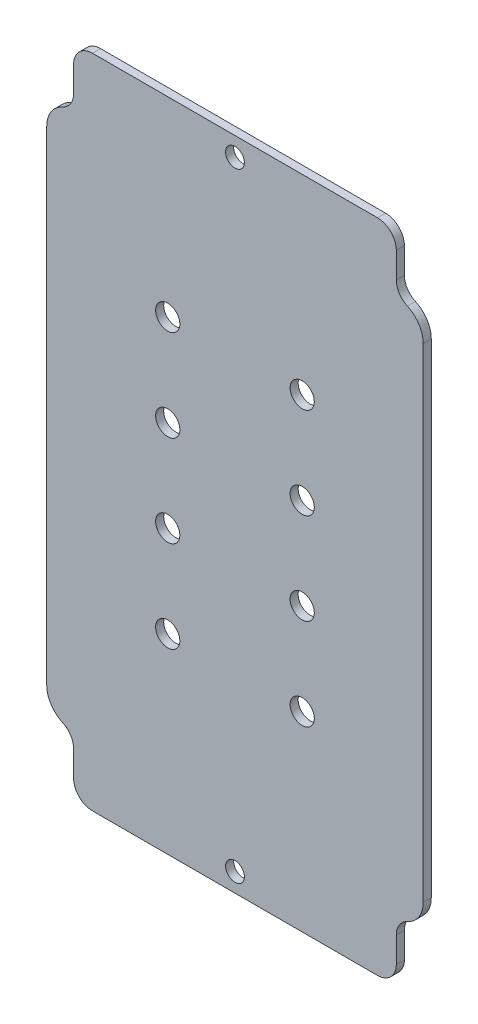
ISO-10303-21;
HEADER;
FILE_DESCRIPTION(('STEP AP214'),'2;1');
FILE_NAME('part.step','',(''),(''),'','','');
FILE_SCHEMA(('AUTOMOTIVE_DESIGN { 1 0 10303 214 1 1 1 1 }'));
ENDSEC;
DATA;
#1=APPLICATION_CONTEXT('core data for automotive mechanical design processes');
#2=APPLICATION_PROTOCOL_DEFINITION('international standard','automotive_design',2000,#1);
#3=PRODUCT_CONTEXT('',#1,'mechanical');
#4=PRODUCT('Part','Part','',(#3));
#5=PRODUCT_RELATED_PRODUCT_CATEGORY('part','',(#4));
#6=PRODUCT_DEFINITION_FORMATION('','',#4);
#7=PRODUCT_DEFINITION_CONTEXT('part definition',#1,'design');
#8=PRODUCT_DEFINITION('design','',#6,#7);
#9=PRODUCT_DEFINITION_SHAPE('','',#8);
#10=(LENGTH_UNIT() NAMED_UNIT(*) SI_UNIT(.MILLI.,.METRE.));
#11=(NAMED_UNIT(*) PLANE_ANGLE_UNIT() SI_UNIT($,.RADIAN.));
#12=(NAMED_UNIT(*) SI_UNIT($,.STERADIAN.) SOLID_ANGLE_UNIT());
#13=UNCERTAINTY_MEASURE_WITH_UNIT(LENGTH_MEASURE(1.E-05),#10,'distance_accuracy_value','');
#14=(GEOMETRIC_REPRESENTATION_CONTEXT(3) GLOBAL_UNCERTAINTY_ASSIGNED_CONTEXT((#13)) GLOBAL_UNIT_ASSIGNED_CONTEXT((#10,
#11,#12)) REPRESENTATION_CONTEXT('',''));
#15=CARTESIAN_POINT('',(0.,0.,0.));
#16=DIRECTION('',(0.,0.,1.));
#17=DIRECTION('',(1.,0.,0.));
#18=AXIS2_PLACEMENT_3D('',#15,#16,#17);
#19=CARTESIAN_POINT('',(123.,215.,123.));
#20=DIRECTION('',(0.,0.,1.));
#21=DIRECTION('',(1.,0.,0.));
#22=AXIS2_PLACEMENT_3D('',#19,#20,#21);
#23=PLANE('',#22);
#24=CARTESIAN_POINT('',(45.,49.,123.));
#25=DIRECTION('',(0.,0.,1.));
#26=DIRECTION('',(-1.,0.,0.));
#27=AXIS2_PLACEMENT_3D('',#24,#25,#26);
#28=CIRCLE('',#27,4.50000000000001);
#29=CARTESIAN_POINT('',(40.5,49.,123.));
#30=VERTEX_POINT('',#29);
#31=EDGE_CURVE('E438',#30,#30,#28,.T.);
#32=ORIENTED_EDGE('',*,*,#31,.F.);
#33=EDGE_LOOP('',(#32));
#34=FACE_BOUND('',#33,.T.);
#35=CARTESIAN_POINT('',(95.,117.,123.));
#36=DIRECTION('',(0.,0.,1.));
#37=DIRECTION('',(1.,0.,0.));
#38=AXIS2_PLACEMENT_3D('',#35,#36,#37);
#39=CIRCLE('',#38,4.50000000000001);
#40=CARTESIAN_POINT('',(99.5,117.,123.));
#41=VERTEX_POINT('',#40);
#42=EDGE_CURVE('E452',#41,#41,#39,.T.);
#43=ORIENTED_EDGE('',*,*,#42,.F.);
#44=EDGE_LOOP('',(#43));
#45=FACE_BOUND('',#44,.T.);
#46=CARTESIAN_POINT('',(45.,117.,123.));
#47=DIRECTION('',(0.,0.,1.));
#48=DIRECTION('',(1.,0.,0.));
#49=AXIS2_PLACEMENT_3D('',#46,#47,#48);
#50=CIRCLE('',#49,4.50000000000001);
#51=CARTESIAN_POINT('',(49.5,117.,123.));
#52=VERTEX_POINT('',#51);
#53=EDGE_CURVE('E464',#52,#52,#50,.T.);
#54=ORIENTED_EDGE('',*,*,#53,.F.);
#55=EDGE_LOOP('',(#54));
#56=FACE_BOUND('',#55,.T.);
#57=CARTESIAN_POINT('',(45.,151.,123.));
#58=DIRECTION('',(0.,0.,1.));
#59=DIRECTION('',(1.,0.,0.));
#60=AXIS2_PLACEMENT_3D('',#57,#58,#59);
#61=CIRCLE('',#60,4.50000000000001);
#62=CARTESIAN_POINT('',(49.5,151.,123.));
#63=VERTEX_POINT('',#62);
#64=EDGE_CURVE('E474',#63,#63,#61,.T.);
#65=ORIENTED_EDGE('',*,*,#64,.F.);
#66=EDGE_LOOP('',(#65));
#67=FACE_BOUND('',#66,.T.);
#68=CARTESIAN_POINT('',(70.,-15.,123.));
#69=DIRECTION('',(0.,0.,1.));
#70=DIRECTION('',(1.,0.,0.));
#71=AXIS2_PLACEMENT_3D('',#68,#69,#70);
#72=CIRCLE('',#71,3.50000000000001);
#73=CARTESIAN_POINT('',(73.5,-15.,123.));
#74=VERTEX_POINT('',#73);
#75=EDGE_CURVE('E225',#74,#74,#72,.T.);
#76=ORIENTED_EDGE('',*,*,#75,.F.);
#77=EDGE_LOOP('',(#76));
#78=FACE_BOUND('',#77,.T.);
#79=CARTESIAN_POINT('',(123.,215.,123.));
#80=DIRECTION('',(0.,0.,1.));
#81=DIRECTION('',(1.,0.,0.));
#82=AXIS2_PLACEMENT_3D('',#79,#80,#81);
#83=CIRCLE('',#82,7.00000000000001);
#84=CARTESIAN_POINT('',(130.,215.,123.));
#85=VERTEX_POINT('',#84);
#86=CARTESIAN_POINT('',(123.,222.,123.));
#87=VERTEX_POINT('',#86);
#88=EDGE_CURVE('E259',#85,#87,#83,.T.);
#89=ORIENTED_EDGE('',*,*,#88,.T.);
#90=DIRECTION('',(-1.,0.,0.));
#91=VECTOR('',#90,1.);
#92=CARTESIAN_POINT('',(123.,222.,123.));
#93=LINE('',#92,#91);
#94=CARTESIAN_POINT('',(17.,222.,123.));
#95=VERTEX_POINT('',#94);
#96=EDGE_CURVE('E144',#87,#95,#93,.T.);
#97=ORIENTED_EDGE('',*,*,#96,.T.);
#98=CARTESIAN_POINT('',(17.,215.,123.));
#99=DIRECTION('',(0.,0.,1.));
#100=DIRECTION('',(1.,0.,0.));
#101=AXIS2_PLACEMENT_3D('',#98,#99,#100);
#102=CIRCLE('',#101,7.);
#103=CARTESIAN_POINT('',(10.,215.,123.));
#104=VERTEX_POINT('',#103);
#105=EDGE_CURVE('E309',#95,#104,#102,.T.);
#106=ORIENTED_EDGE('',*,*,#105,.T.);
#107=DIRECTION('',(0.,-1.,0.));
#108=VECTOR('',#107,1.);
#109=CARTESIAN_POINT('',(10.,215.,123.));
#110=LINE('',#109,#108);
#111=CARTESIAN_POINT('',(10.,205.49193338483,123.));
#112=VERTEX_POINT('',#111);
#113=EDGE_CURVE('E328',#104,#112,#110,.T.);
#114=ORIENTED_EDGE('',*,*,#113,.T.);
#115=CARTESIAN_POINT('',(3.00000000000001,205.49193338483,123.));
#116=DIRECTION('',(0.,0.,-1.));
#117=DIRECTION('',(1.,0.,0.));
#118=AXIS2_PLACEMENT_3D('',#115,#116,#117);
#119=CIRCLE('',#118,7.);
#120=CARTESIAN_POINT('',(5.88235294117648,199.112901991076,123.));
#121=VERTEX_POINT('',#120);
#122=EDGE_CURVE('E326',#112,#121,#119,.T.);
#123=ORIENTED_EDGE('',*,*,#122,.T.);
#124=CARTESIAN_POINT('',(10.,190.,123.));
#125=DIRECTION('',(0.,0.,1.));
#126=DIRECTION('',(1.,0.,0.));
#127=AXIS2_PLACEMENT_3D('',#124,#125,#126);
#128=CIRCLE('',#127,10.);
#129=CARTESIAN_POINT('',(0.,190.,123.));
#130=VERTEX_POINT('',#129);
#131=EDGE_CURVE('E327',#121,#130,#128,.T.);
#132=ORIENTED_EDGE('',*,*,#131,.T.);
#133=DIRECTION('',(0.,-1.,0.));
#134=VECTOR('',#133,1.);
#135=CARTESIAN_POINT('',(0.,190.,123.));
#136=LINE('',#135,#134);
#137=CARTESIAN_POINT('',(0.,10.,123.));
#138=VERTEX_POINT('',#137);
#139=EDGE_CURVE('E332',#130,#138,#136,.T.);
#140=ORIENTED_EDGE('',*,*,#139,.T.);
#141=CARTESIAN_POINT('',(9.99999999999997,10.,123.));
#142=DIRECTION('',(0.,0.,1.));
#143=DIRECTION('',(-1.,0.,0.));
#144=AXIS2_PLACEMENT_3D('',#141,#142,#143);
#145=CIRCLE('',#144,10.);
#146=CARTESIAN_POINT('',(5.88235294117645,0.88709800892372,123.));
#147=VERTEX_POINT('',#146);
#148=EDGE_CURVE('E340',#138,#147,#145,.T.);
#149=ORIENTED_EDGE('',*,*,#148,.T.);
#150=CARTESIAN_POINT('',(2.99999999999997,-5.49193338482967,123.));
#151=DIRECTION('',(0.,0.,-1.));
#152=DIRECTION('',(-1.,0.,0.));
#153=AXIS2_PLACEMENT_3D('',#150,#151,#152);
#154=CIRCLE('',#153,7.);
#155=CARTESIAN_POINT('',(9.99999999999997,-5.49193338482967,123.));
#156=VERTEX_POINT('',#155);
#157=EDGE_CURVE('E336',#147,#156,#154,.T.);
#158=ORIENTED_EDGE('',*,*,#157,.T.);
#159=DIRECTION('',(0.,-1.,0.));
#160=VECTOR('',#159,1.);
#161=CARTESIAN_POINT('',(10.,-15.,123.));
#162=LINE('',#161,#160);
#163=CARTESIAN_POINT('',(10.,-15.,123.));
#164=VERTEX_POINT('',#163);
#165=EDGE_CURVE('E342',#156,#164,#162,.T.);
#166=ORIENTED_EDGE('',*,*,#165,.T.);
#167=CARTESIAN_POINT('',(17.,-15.,123.));
#168=DIRECTION('',(0.,0.,1.));
#169=DIRECTION('',(-1.,0.,0.));
#170=AXIS2_PLACEMENT_3D('',#167,#168,#169);
#171=CIRCLE('',#170,7.);
#172=CARTESIAN_POINT('',(17.,-22.,123.));
#173=VERTEX_POINT('',#172);
#174=EDGE_CURVE('E343',#164,#173,#171,.T.);
#175=ORIENTED_EDGE('',*,*,#174,.T.);
#176=DIRECTION('',(1.,0.,0.));
#177=VECTOR('',#176,1.);
#178=CARTESIAN_POINT('',(123.,-22.,123.));
#179=LINE('',#178,#177);
#180=CARTESIAN_POINT('',(123.,-22.,123.));
#181=VERTEX_POINT('',#180);
#182=EDGE_CURVE('E341',#173,#181,#179,.T.);
#183=ORIENTED_EDGE('',*,*,#182,.T.);
#184=CARTESIAN_POINT('',(123.,-15.,123.));
#185=DIRECTION('',(0.,0.,1.));
#186=DIRECTION('',(-1.,0.,0.));
#187=AXIS2_PLACEMENT_3D('',#184,#185,#186);
#188=CIRCLE('',#187,7.00000000000001);
#189=CARTESIAN_POINT('',(130.,-15.,123.));
#190=VERTEX_POINT('',#189);
#191=EDGE_CURVE('E350',#181,#190,#188,.T.);
#192=ORIENTED_EDGE('',*,*,#191,.T.);
#193=DIRECTION('',(0.,1.,0.));
#194=VECTOR('',#193,1.);
#195=CARTESIAN_POINT('',(130.,-5.49193338482973,123.));
#196=LINE('',#195,#194);
#197=CARTESIAN_POINT('',(130.,-5.49193338482973,123.));
#198=VERTEX_POINT('',#197);
#199=EDGE_CURVE('E349',#190,#198,#196,.T.);
#200=ORIENTED_EDGE('',*,*,#199,.T.);
#201=CARTESIAN_POINT('',(137.,-5.49193338482973,123.));
#202=DIRECTION('',(0.,0.,-1.));
#203=DIRECTION('',(-1.,0.,0.));
#204=AXIS2_PLACEMENT_3D('',#201,#202,#203);
#205=CIRCLE('',#204,7.00000000000001);
#206=CARTESIAN_POINT('',(134.117647058823,0.887098008923669,123.));
#207=VERTEX_POINT('',#206);
#208=EDGE_CURVE('E352',#198,#207,#205,.T.);
#209=ORIENTED_EDGE('',*,*,#208,.T.);
#210=CARTESIAN_POINT('',(130.,9.99999999999995,123.));
#211=DIRECTION('',(0.,0.,1.));
#212=DIRECTION('',(-1.,0.,0.));
#213=AXIS2_PLACEMENT_3D('',#210,#211,#212);
#214=CIRCLE('',#213,10.);
#215=CARTESIAN_POINT('',(140.,9.99999999999996,123.));
#216=VERTEX_POINT('',#215);
#217=EDGE_CURVE('E354',#207,#216,#214,.T.);
#218=ORIENTED_EDGE('',*,*,#217,.T.);
#219=DIRECTION('',(0.,1.,0.));
#220=VECTOR('',#219,1.);
#221=CARTESIAN_POINT('',(140.,30.,123.));
#222=LINE('',#221,#220);
#223=CARTESIAN_POINT('',(140.,190.,123.));
#224=VERTEX_POINT('',#223);
#225=EDGE_CURVE('E199',#216,#224,#222,.T.);
#226=ORIENTED_EDGE('',*,*,#225,.T.);
#227=CARTESIAN_POINT('',(130.,190.,123.));
#228=DIRECTION('',(0.,0.,1.));
#229=DIRECTION('',(1.,0.,0.));
#230=AXIS2_PLACEMENT_3D('',#227,#228,#229);
#231=CIRCLE('',#230,10.);
#232=CARTESIAN_POINT('',(134.117647058824,199.112901991076,123.));
#233=VERTEX_POINT('',#232);
#234=EDGE_CURVE('E194',#224,#233,#231,.T.);
#235=ORIENTED_EDGE('',*,*,#234,.T.);
#236=CARTESIAN_POINT('',(137.,205.49193338483,123.));
#237=DIRECTION('',(0.,0.,-1.));
#238=DIRECTION('',(1.,0.,0.));
#239=AXIS2_PLACEMENT_3D('',#236,#237,#238);
#240=CIRCLE('',#239,7.00000000000001);
#241=CARTESIAN_POINT('',(130.,205.49193338483,123.));
#242=VERTEX_POINT('',#241);
#243=EDGE_CURVE('E196',#233,#242,#240,.T.);
#244=ORIENTED_EDGE('',*,*,#243,.T.);
#245=DIRECTION('',(0.,1.,0.));
#246=VECTOR('',#245,1.);
#247=CARTESIAN_POINT('',(130.,205.49193338483,123.));
#248=LINE('',#247,#246);
#249=EDGE_CURVE('E67',#242,#85,#248,.T.);
#250=ORIENTED_EDGE('',*,*,#249,.T.);
#251=EDGE_LOOP('',(#89,#97,#106,#114,#123,#132,#140,#149,#158,#166,#175,#183,#192,#200,#209,
#218,#226,#235,#244,#250));
#252=FACE_BOUND('',#251,.T.);
#253=CARTESIAN_POINT('',(70.,215.,123.));
#254=DIRECTION('',(0.,0.,1.));
#255=DIRECTION('',(1.,0.,0.));
#256=AXIS2_PLACEMENT_3D('',#253,#254,#255);
#257=CIRCLE('',#256,3.50000000000001);
#258=CARTESIAN_POINT('',(73.5,215.,123.));
#259=VERTEX_POINT('',#258);
#260=EDGE_CURVE('E481',#259,#259,#257,.T.);
#261=ORIENTED_EDGE('',*,*,#260,.F.);
#262=EDGE_LOOP('',(#261));
#263=FACE_BOUND('',#262,.T.);
#264=CARTESIAN_POINT('',(95.,151.,123.));
#265=DIRECTION('',(0.,0.,1.));
#266=DIRECTION('',(1.,0.,0.));
#267=AXIS2_PLACEMENT_3D('',#264,#265,#266);
#268=CIRCLE('',#267,4.50000000000001);
#269=CARTESIAN_POINT('',(99.5,151.,123.));
#270=VERTEX_POINT('',#269);
#271=EDGE_CURVE('E469',#270,#270,#268,.T.);
#272=ORIENTED_EDGE('',*,*,#271,.F.);
#273=EDGE_LOOP('',(#272));
#274=FACE_BOUND('',#273,.T.);
#275=CARTESIAN_POINT('',(95.,83.,123.));
#276=DIRECTION('',(0.,0.,1.));
#277=DIRECTION('',(-1.,0.,0.));
#278=AXIS2_PLACEMENT_3D('',#275,#276,#277);
#279=CIRCLE('',#278,4.50000000000001);
#280=CARTESIAN_POINT('',(90.5,83.,123.));
#281=VERTEX_POINT('',#280);
#282=EDGE_CURVE('E460',#281,#281,#279,.T.);
#283=ORIENTED_EDGE('',*,*,#282,.F.);
#284=EDGE_LOOP('',(#283));
#285=FACE_BOUND('',#284,.T.);
#286=CARTESIAN_POINT('',(95.,49.,123.));
#287=DIRECTION('',(0.,0.,1.));
#288=DIRECTION('',(-1.,0.,0.));
#289=AXIS2_PLACEMENT_3D('',#286,#287,#288);
#290=CIRCLE('',#289,4.50000000000001);
#291=CARTESIAN_POINT('',(90.5,49.,123.));
#292=VERTEX_POINT('',#291);
#293=EDGE_CURVE('E443',#292,#292,#290,.T.);
#294=ORIENTED_EDGE('',*,*,#293,.F.);
#295=EDGE_LOOP('',(#294));
#296=FACE_BOUND('',#295,.T.);
#297=CARTESIAN_POINT('',(45.,83.,123.));
#298=DIRECTION('',(0.,0.,1.));
#299=DIRECTION('',(-1.,0.,0.));
#300=AXIS2_PLACEMENT_3D('',#297,#298,#299);
#301=CIRCLE('',#300,4.50000000000001);
#302=CARTESIAN_POINT('',(40.5,83.,123.));
#303=VERTEX_POINT('',#302);
#304=EDGE_CURVE('E429',#303,#303,#301,.T.);
#305=ORIENTED_EDGE('',*,*,#304,.F.);
#306=EDGE_LOOP('',(#305));
#307=FACE_BOUND('',#306,.T.);
#308=ADVANCED_FACE('F47',(#34,#45,#56,#67,#78,#252,#263,#274,#285,#296,#307),#23,.T.);
#309=CARTESIAN_POINT('',(123.,215.,120.));
#310=DIRECTION('',(0.,0.,1.));
#311=DIRECTION('',(1.,0.,0.));
#312=AXIS2_PLACEMENT_3D('',#309,#310,#311);
#313=PLANE('',#312);
#314=CARTESIAN_POINT('',(123.,215.,120.));
#315=DIRECTION('',(0.,0.,1.));
#316=DIRECTION('',(1.,0.,0.));
#317=AXIS2_PLACEMENT_3D('',#314,#315,#316);
#318=CIRCLE('',#317,7.00000000000001);
#319=CARTESIAN_POINT('',(130.,215.,120.));
#320=VERTEX_POINT('',#319);
#321=CARTESIAN_POINT('',(123.,222.,120.));
#322=VERTEX_POINT('',#321);
#323=EDGE_CURVE('E217',#320,#322,#318,.T.);
#324=ORIENTED_EDGE('',*,*,#323,.F.);
#325=DIRECTION('',(0.,1.,0.));
#326=VECTOR('',#325,1.);
#327=CARTESIAN_POINT('',(130.,205.49193338483,120.));
#328=LINE('',#327,#326);
#329=CARTESIAN_POINT('',(130.,205.49193338483,120.));
#330=VERTEX_POINT('',#329);
#331=EDGE_CURVE('E140',#330,#320,#328,.T.);
#332=ORIENTED_EDGE('',*,*,#331,.F.);
#333=CARTESIAN_POINT('',(137.,205.49193338483,120.));
#334=DIRECTION('',(0.,0.,-1.));
#335=DIRECTION('',(1.,0.,0.));
#336=AXIS2_PLACEMENT_3D('',#333,#334,#335);
#337=CIRCLE('',#336,7.00000000000001);
#338=CARTESIAN_POINT('',(134.117647058824,199.112901991076,120.));
#339=VERTEX_POINT('',#338);
#340=EDGE_CURVE('E132',#339,#330,#337,.T.);
#341=ORIENTED_EDGE('',*,*,#340,.F.);
#342=CARTESIAN_POINT('',(130.,190.,120.));
#343=DIRECTION('',(0.,0.,1.));
#344=DIRECTION('',(1.,0.,0.));
#345=AXIS2_PLACEMENT_3D('',#342,#343,#344);
#346=CIRCLE('',#345,10.);
#347=CARTESIAN_POINT('',(140.,190.,120.));
#348=VERTEX_POINT('',#347);
#349=EDGE_CURVE('E208',#348,#339,#346,.T.);
#350=ORIENTED_EDGE('',*,*,#349,.F.);
#351=DIRECTION('',(0.,1.,0.));
#352=VECTOR('',#351,1.);
#353=CARTESIAN_POINT('',(140.,170.,120.));
#354=LINE('',#353,#352);
#355=CARTESIAN_POINT('',(140.,9.99999999999996,120.));
#356=VERTEX_POINT('',#355);
#357=EDGE_CURVE('E255',#356,#348,#354,.T.);
#358=ORIENTED_EDGE('',*,*,#357,.F.);
#359=CARTESIAN_POINT('',(130.,9.99999999999995,120.));
#360=DIRECTION('',(0.,0.,1.));
#361=DIRECTION('',(-1.,0.,0.));
#362=AXIS2_PLACEMENT_3D('',#359,#360,#361);
#363=CIRCLE('',#362,10.);
#364=CARTESIAN_POINT('',(134.117647058823,0.887098008923669,120.));
#365=VERTEX_POINT('',#364);
#366=EDGE_CURVE('E253',#365,#356,#363,.T.);
#367=ORIENTED_EDGE('',*,*,#366,.F.);
#368=CARTESIAN_POINT('',(137.,-5.49193338482973,120.));
#369=DIRECTION('',(0.,0.,-1.));
#370=DIRECTION('',(-1.,0.,0.));
#371=AXIS2_PLACEMENT_3D('',#368,#369,#370);
#372=CIRCLE('',#371,7.00000000000001);
#373=CARTESIAN_POINT('',(130.,-5.49193338482973,120.));
#374=VERTEX_POINT('',#373);
#375=EDGE_CURVE('E249',#374,#365,#372,.T.);
#376=ORIENTED_EDGE('',*,*,#375,.F.);
#377=DIRECTION('',(0.,1.,0.));
#378=VECTOR('',#377,1.);
#379=CARTESIAN_POINT('',(130.,-5.49193338482973,120.));
#380=LINE('',#379,#378);
#381=CARTESIAN_POINT('',(130.,-15.,120.));
#382=VERTEX_POINT('',#381);
#383=EDGE_CURVE('E250',#382,#374,#380,.T.);
#384=ORIENTED_EDGE('',*,*,#383,.F.);
#385=CARTESIAN_POINT('',(123.,-15.,120.));
#386=DIRECTION('',(0.,0.,1.));
#387=DIRECTION('',(-1.,0.,0.));
#388=AXIS2_PLACEMENT_3D('',#385,#386,#387);
#389=CIRCLE('',#388,7.00000000000001);
#390=CARTESIAN_POINT('',(123.,-22.,120.));
#391=VERTEX_POINT('',#390);
#392=EDGE_CURVE('E243',#391,#382,#389,.T.);
#393=ORIENTED_EDGE('',*,*,#392,.F.);
#394=DIRECTION('',(1.,0.,0.));
#395=VECTOR('',#394,1.);
#396=CARTESIAN_POINT('',(123.,-22.,120.));
#397=LINE('',#396,#395);
#398=CARTESIAN_POINT('',(17.,-22.,120.));
#399=VERTEX_POINT('',#398);
#400=EDGE_CURVE('E244',#399,#391,#397,.T.);
#401=ORIENTED_EDGE('',*,*,#400,.F.);
#402=CARTESIAN_POINT('',(17.,-15.,120.));
#403=DIRECTION('',(0.,0.,1.));
#404=DIRECTION('',(-1.,0.,0.));
#405=AXIS2_PLACEMENT_3D('',#402,#403,#404);
#406=CIRCLE('',#405,7.);
#407=CARTESIAN_POINT('',(10.,-15.,120.));
#408=VERTEX_POINT('',#407);
#409=EDGE_CURVE('E242',#408,#399,#406,.T.);
#410=ORIENTED_EDGE('',*,*,#409,.F.);
#411=DIRECTION('',(0.,-1.,0.));
#412=VECTOR('',#411,1.);
#413=CARTESIAN_POINT('',(10.,-15.,120.));
#414=LINE('',#413,#412);
#415=CARTESIAN_POINT('',(9.99999999999997,-5.49193338482967,120.));
#416=VERTEX_POINT('',#415);
#417=EDGE_CURVE('E239',#416,#408,#414,.T.);
#418=ORIENTED_EDGE('',*,*,#417,.F.);
#419=CARTESIAN_POINT('',(2.99999999999997,-5.49193338482967,120.));
#420=DIRECTION('',(0.,0.,-1.));
#421=DIRECTION('',(-1.,0.,0.));
#422=AXIS2_PLACEMENT_3D('',#419,#420,#421);
#423=CIRCLE('',#422,7.);
#424=CARTESIAN_POINT('',(5.88235294117645,0.88709800892372,120.));
#425=VERTEX_POINT('',#424);
#426=EDGE_CURVE('E240',#425,#416,#423,.T.);
#427=ORIENTED_EDGE('',*,*,#426,.F.);
#428=CARTESIAN_POINT('',(9.99999999999997,10.,120.));
#429=DIRECTION('',(0.,0.,1.));
#430=DIRECTION('',(-1.,0.,0.));
#431=AXIS2_PLACEMENT_3D('',#428,#429,#430);
#432=CIRCLE('',#431,10.);
#433=CARTESIAN_POINT('',(0.,10.,120.));
#434=VERTEX_POINT('',#433);
#435=EDGE_CURVE('E231',#434,#425,#432,.T.);
#436=ORIENTED_EDGE('',*,*,#435,.F.);
#437=DIRECTION('',(0.,-1.,0.));
#438=VECTOR('',#437,1.);
#439=CARTESIAN_POINT('',(0.,10.,120.));
#440=LINE('',#439,#438);
#441=CARTESIAN_POINT('',(0.,190.,120.));
#442=VERTEX_POINT('',#441);
#443=EDGE_CURVE('E233',#442,#434,#440,.T.);
#444=ORIENTED_EDGE('',*,*,#443,.F.);
#445=CARTESIAN_POINT('',(10.,190.,120.));
#446=DIRECTION('',(0.,0.,1.));
#447=DIRECTION('',(1.,0.,0.));
#448=AXIS2_PLACEMENT_3D('',#445,#446,#447);
#449=CIRCLE('',#448,10.);
#450=CARTESIAN_POINT('',(5.88235294117648,199.112901991076,120.));
#451=VERTEX_POINT('',#450);
#452=EDGE_CURVE('E228',#451,#442,#449,.T.);
#453=ORIENTED_EDGE('',*,*,#452,.F.);
#454=CARTESIAN_POINT('',(3.00000000000001,205.49193338483,120.));
#455=DIRECTION('',(0.,0.,-1.));
#456=DIRECTION('',(1.,0.,0.));
#457=AXIS2_PLACEMENT_3D('',#454,#455,#456);
#458=CIRCLE('',#457,7.);
#459=CARTESIAN_POINT('',(10.,205.49193338483,120.));
#460=VERTEX_POINT('',#459);
#461=EDGE_CURVE('E229',#460,#451,#458,.T.);
#462=ORIENTED_EDGE('',*,*,#461,.F.);
#463=DIRECTION('',(0.,-1.,0.));
#464=VECTOR('',#463,1.);
#465=CARTESIAN_POINT('',(10.,215.,120.));
#466=LINE('',#465,#464);
#467=CARTESIAN_POINT('',(10.,215.,120.));
#468=VERTEX_POINT('',#467);
#469=EDGE_CURVE('E227',#468,#460,#466,.T.);
#470=ORIENTED_EDGE('',*,*,#469,.F.);
#471=CARTESIAN_POINT('',(17.,215.,120.));
#472=DIRECTION('',(0.,0.,1.));
#473=DIRECTION('',(1.,0.,0.));
#474=AXIS2_PLACEMENT_3D('',#471,#472,#473);
#475=CIRCLE('',#474,7.);
#476=CARTESIAN_POINT('',(17.,222.,120.));
#477=VERTEX_POINT('',#476);
#478=EDGE_CURVE('E221',#477,#468,#475,.T.);
#479=ORIENTED_EDGE('',*,*,#478,.F.);
#480=DIRECTION('',(-1.,0.,0.));
#481=VECTOR('',#480,1.);
#482=CARTESIAN_POINT('',(123.,222.,120.));
#483=LINE('',#482,#481);
#484=EDGE_CURVE('E222',#322,#477,#483,.T.);
#485=ORIENTED_EDGE('',*,*,#484,.F.);
#486=EDGE_LOOP('',(#324,#332,#341,#350,#358,#367,#376,#384,#393,#401,#410,#418,#427,#436,#444,
#453,#462,#470,#479,#485));
#487=FACE_BOUND('',#486,.T.);
#488=CARTESIAN_POINT('',(70.,-15.,120.));
#489=DIRECTION('',(0.,0.,1.));
#490=DIRECTION('',(1.,0.,0.));
#491=AXIS2_PLACEMENT_3D('',#488,#489,#490);
#492=CIRCLE('',#491,3.50000000000001);
#493=CARTESIAN_POINT('',(73.5,-15.,120.));
#494=VERTEX_POINT('',#493);
#495=EDGE_CURVE('E482',#494,#494,#492,.T.);
#496=ORIENTED_EDGE('',*,*,#495,.T.);
#497=EDGE_LOOP('',(#496));
#498=FACE_BOUND('',#497,.T.);
#499=CARTESIAN_POINT('',(70.,215.,120.));
#500=DIRECTION('',(0.,0.,1.));
#501=DIRECTION('',(1.,0.,0.));
#502=AXIS2_PLACEMENT_3D('',#499,#500,#501);
#503=CIRCLE('',#502,3.50000000000001);
#504=CARTESIAN_POINT('',(73.5,215.,120.));
#505=VERTEX_POINT('',#504);
#506=EDGE_CURVE('E476',#505,#505,#503,.T.);
#507=ORIENTED_EDGE('',*,*,#506,.T.);
#508=EDGE_LOOP('',(#507));
#509=FACE_BOUND('',#508,.T.);
#510=CARTESIAN_POINT('',(45.,151.,120.));
#511=DIRECTION('',(0.,0.,1.));
#512=DIRECTION('',(1.,0.,0.));
#513=AXIS2_PLACEMENT_3D('',#510,#511,#512);
#514=CIRCLE('',#513,4.50000000000001);
#515=CARTESIAN_POINT('',(49.5,151.,120.));
#516=VERTEX_POINT('',#515);
#517=EDGE_CURVE('E472',#516,#516,#514,.T.);
#518=ORIENTED_EDGE('',*,*,#517,.T.);
#519=EDGE_LOOP('',(#518));
#520=FACE_BOUND('',#519,.T.);
#521=CARTESIAN_POINT('',(95.,151.,120.));
#522=DIRECTION('',(0.,0.,1.));
#523=DIRECTION('',(1.,0.,0.));
#524=AXIS2_PLACEMENT_3D('',#521,#522,#523);
#525=CIRCLE('',#524,4.50000000000001);
#526=CARTESIAN_POINT('',(99.5,151.,120.));
#527=VERTEX_POINT('',#526);
#528=EDGE_CURVE('E467',#527,#527,#525,.T.);
#529=ORIENTED_EDGE('',*,*,#528,.T.);
#530=EDGE_LOOP('',(#529));
#531=FACE_BOUND('',#530,.T.);
#532=CARTESIAN_POINT('',(45.,117.,120.));
#533=DIRECTION('',(0.,0.,1.));
#534=DIRECTION('',(1.,0.,0.));
#535=AXIS2_PLACEMENT_3D('',#532,#533,#534);
#536=CIRCLE('',#535,4.50000000000001);
#537=CARTESIAN_POINT('',(49.5,117.,120.));
#538=VERTEX_POINT('',#537);
#539=EDGE_CURVE('E458',#538,#538,#536,.T.);
#540=ORIENTED_EDGE('',*,*,#539,.T.);
#541=EDGE_LOOP('',(#540));
#542=FACE_BOUND('',#541,.T.);
#543=CARTESIAN_POINT('',(95.,83.,120.));
#544=DIRECTION('',(0.,0.,1.));
#545=DIRECTION('',(-1.,0.,0.));
#546=AXIS2_PLACEMENT_3D('',#543,#544,#545);
#547=CIRCLE('',#546,4.50000000000001);
#548=CARTESIAN_POINT('',(90.5,83.,120.));
#549=VERTEX_POINT('',#548);
#550=EDGE_CURVE('E454',#549,#549,#547,.T.);
#551=ORIENTED_EDGE('',*,*,#550,.T.);
#552=EDGE_LOOP('',(#551));
#553=FACE_BOUND('',#552,.T.);
#554=CARTESIAN_POINT('',(95.,117.,120.));
#555=DIRECTION('',(0.,0.,1.));
#556=DIRECTION('',(1.,0.,0.));
#557=AXIS2_PLACEMENT_3D('',#554,#555,#556);
#558=CIRCLE('',#557,4.50000000000001);
#559=CARTESIAN_POINT('',(99.5,117.,120.));
#560=VERTEX_POINT('',#559);
#561=EDGE_CURVE('E449',#560,#560,#558,.T.);
#562=ORIENTED_EDGE('',*,*,#561,.T.);
#563=EDGE_LOOP('',(#562));
#564=FACE_BOUND('',#563,.T.);
#565=CARTESIAN_POINT('',(95.,49.,120.));
#566=DIRECTION('',(0.,0.,1.));
#567=DIRECTION('',(-1.,0.,0.));
#568=AXIS2_PLACEMENT_3D('',#565,#566,#567);
#569=CIRCLE('',#568,4.50000000000001);
#570=CARTESIAN_POINT('',(90.5,49.,120.));
#571=VERTEX_POINT('',#570);
#572=EDGE_CURVE('E445',#571,#571,#569,.T.);
#573=ORIENTED_EDGE('',*,*,#572,.T.);
#574=EDGE_LOOP('',(#573));
#575=FACE_BOUND('',#574,.T.);
#576=CARTESIAN_POINT('',(45.,49.,120.));
#577=DIRECTION('',(0.,0.,1.));
#578=DIRECTION('',(-1.,0.,0.));
#579=AXIS2_PLACEMENT_3D('',#576,#577,#578);
#580=CIRCLE('',#579,4.50000000000001);
#581=CARTESIAN_POINT('',(40.5,49.,120.));
#582=VERTEX_POINT('',#581);
#583=EDGE_CURVE('E436',#582,#582,#580,.T.);
#584=ORIENTED_EDGE('',*,*,#583,.T.);
#585=EDGE_LOOP('',(#584));
#586=FACE_BOUND('',#585,.T.);
#587=CARTESIAN_POINT('',(45.,83.,120.));
#588=DIRECTION('',(0.,0.,1.));
#589=DIRECTION('',(-1.,0.,0.));
#590=AXIS2_PLACEMENT_3D('',#587,#588,#589);
#591=CIRCLE('',#590,4.50000000000001);
#592=CARTESIAN_POINT('',(40.5,83.,120.));
#593=VERTEX_POINT('',#592);
#594=EDGE_CURVE('E433',#593,#593,#591,.T.);
#595=ORIENTED_EDGE('',*,*,#594,.T.);
#596=EDGE_LOOP('',(#595));
#597=FACE_BOUND('',#596,.T.);
#598=ADVANCED_FACE('F314',(#487,#498,#509,#520,#531,#542,#553,#564,#575,#586,#597),#313,.F.);
#599=CARTESIAN_POINT('',(123.,215.,123.));
#600=DIRECTION('',(0.,0.,-1.));
#601=DIRECTION('',(-1.,0.,0.));
#602=AXIS2_PLACEMENT_3D('',#599,#600,#601);
#603=CYLINDRICAL_SURFACE('',#602,7.00000000000001);
#604=ORIENTED_EDGE('',*,*,#323,.T.);
#605=DIRECTION('',(0.,0.,-1.));
#606=VECTOR('',#605,1.);
#607=CARTESIAN_POINT('',(123.,222.,123.));
#608=LINE('',#607,#606);
#609=EDGE_CURVE('E11',#87,#322,#608,.T.);
#610=ORIENTED_EDGE('',*,*,#609,.F.);
#611=ORIENTED_EDGE('',*,*,#88,.F.);
#612=DIRECTION('',(0.,0.,-1.));
#613=VECTOR('',#612,1.);
#614=CARTESIAN_POINT('',(130.,215.,123.));
#615=LINE('',#614,#613);
#616=EDGE_CURVE('E212',#85,#320,#615,.T.);
#617=ORIENTED_EDGE('',*,*,#616,.T.);
#618=EDGE_LOOP('',(#604,#610,#611,#617));
#619=FACE_BOUND('',#618,.T.);
#620=ADVANCED_FACE('F51',(#619),#603,.T.);
#621=CARTESIAN_POINT('',(123.,222.,123.));
#622=DIRECTION('',(0.,-1.,0.));
#623=DIRECTION('',(0.,0.,-1.));
#624=AXIS2_PLACEMENT_3D('',#621,#622,#623);
#625=PLANE('',#624);
#626=ORIENTED_EDGE('',*,*,#484,.T.);
#627=DIRECTION('',(0.,0.,-1.));
#628=VECTOR('',#627,1.);
#629=CARTESIAN_POINT('',(17.,222.,123.));
#630=LINE('',#629,#628);
#631=EDGE_CURVE('E59',#95,#477,#630,.T.);
#632=ORIENTED_EDGE('',*,*,#631,.F.);
#633=ORIENTED_EDGE('',*,*,#96,.F.);
#634=ORIENTED_EDGE('',*,*,#609,.T.);
#635=EDGE_LOOP('',(#626,#632,#633,#634));
#636=FACE_BOUND('',#635,.T.);
#637=ADVANCED_FACE('F604',(#636),#625,.F.);
#638=CARTESIAN_POINT('',(17.,215.,123.));
#639=DIRECTION('',(0.,0.,-1.));
#640=DIRECTION('',(-1.,0.,0.));
#641=AXIS2_PLACEMENT_3D('',#638,#639,#640);
#642=CYLINDRICAL_SURFACE('',#641,7.);
#643=ORIENTED_EDGE('',*,*,#478,.T.);
#644=DIRECTION('',(0.,0.,-1.));
#645=VECTOR('',#644,1.);
#646=CARTESIAN_POINT('',(10.,215.,123.));
#647=LINE('',#646,#645);
#648=EDGE_CURVE('E305',#104,#468,#647,.T.);
#649=ORIENTED_EDGE('',*,*,#648,.F.);
#650=ORIENTED_EDGE('',*,*,#105,.F.);
#651=ORIENTED_EDGE('',*,*,#631,.T.);
#652=EDGE_LOOP('',(#643,#649,#650,#651));
#653=FACE_BOUND('',#652,.T.);
#654=ADVANCED_FACE('F306',(#653),#642,.T.);
#655=CARTESIAN_POINT('',(10.,215.,123.));
#656=DIRECTION('',(1.,0.,0.));
#657=DIRECTION('',(0.,1.,0.));
#658=AXIS2_PLACEMENT_3D('',#655,#656,#657);
#659=PLANE('',#658);
#660=ORIENTED_EDGE('',*,*,#469,.T.);
#661=DIRECTION('',(0.,0.,-1.));
#662=VECTOR('',#661,1.);
#663=CARTESIAN_POINT('',(10.,205.49193338483,123.));
#664=LINE('',#663,#662);
#665=EDGE_CURVE('E296',#112,#460,#664,.T.);
#666=ORIENTED_EDGE('',*,*,#665,.F.);
#667=ORIENTED_EDGE('',*,*,#113,.F.);
#668=ORIENTED_EDGE('',*,*,#648,.T.);
#669=EDGE_LOOP('',(#660,#666,#667,#668));
#670=FACE_BOUND('',#669,.T.);
#671=ADVANCED_FACE('F319',(#670),#659,.F.);
#672=CARTESIAN_POINT('',(3.00000000000001,205.49193338483,123.));
#673=DIRECTION('',(0.,0.,-1.));
#674=DIRECTION('',(-1.,0.,0.));
#675=AXIS2_PLACEMENT_3D('',#672,#673,#674);
#676=CYLINDRICAL_SURFACE('',#675,7.);
#677=ORIENTED_EDGE('',*,*,#461,.T.);
#678=DIRECTION('',(0.,0.,-1.));
#679=VECTOR('',#678,1.);
#680=CARTESIAN_POINT('',(5.88235294117648,199.112901991076,123.));
#681=LINE('',#680,#679);
#682=EDGE_CURVE('E297',#121,#451,#681,.T.);
#683=ORIENTED_EDGE('',*,*,#682,.F.);
#684=ORIENTED_EDGE('',*,*,#122,.F.);
#685=ORIENTED_EDGE('',*,*,#665,.T.);
#686=EDGE_LOOP('',(#677,#683,#684,#685));
#687=FACE_BOUND('',#686,.T.);
#688=ADVANCED_FACE('F322',(#687),#676,.F.);
#689=CARTESIAN_POINT('',(10.,190.,123.));
#690=DIRECTION('',(0.,0.,-1.));
#691=DIRECTION('',(-1.,0.,0.));
#692=AXIS2_PLACEMENT_3D('',#689,#690,#691);
#693=CYLINDRICAL_SURFACE('',#692,10.);
#694=ORIENTED_EDGE('',*,*,#452,.T.);
#695=DIRECTION('',(0.,0.,-1.));
#696=VECTOR('',#695,1.);
#697=CARTESIAN_POINT('',(0.,190.,123.));
#698=LINE('',#697,#696);
#699=EDGE_CURVE('E291',#130,#442,#698,.T.);
#700=ORIENTED_EDGE('',*,*,#699,.F.);
#701=ORIENTED_EDGE('',*,*,#131,.F.);
#702=ORIENTED_EDGE('',*,*,#682,.T.);
#703=EDGE_LOOP('',(#694,#700,#701,#702));
#704=FACE_BOUND('',#703,.T.);
#705=ADVANCED_FACE('F635',(#704),#693,.T.);
#706=CARTESIAN_POINT('',(0.,10.,123.));
#707=DIRECTION('',(1.,0.,0.));
#708=DIRECTION('',(0.,1.,0.));
#709=AXIS2_PLACEMENT_3D('',#706,#707,#708);
#710=PLANE('',#709);
#711=ORIENTED_EDGE('',*,*,#443,.T.);
#712=DIRECTION('',(0.,0.,-1.));
#713=VECTOR('',#712,1.);
#714=CARTESIAN_POINT('',(0.,10.,123.));
#715=LINE('',#714,#713);
#716=EDGE_CURVE('E286',#138,#434,#715,.T.);
#717=ORIENTED_EDGE('',*,*,#716,.F.);
#718=ORIENTED_EDGE('',*,*,#139,.F.);
#719=ORIENTED_EDGE('',*,*,#699,.T.);
#720=EDGE_LOOP('',(#711,#717,#718,#719));
#721=FACE_BOUND('',#720,.T.);
#722=ADVANCED_FACE('F639',(#721),#710,.F.);
#723=CARTESIAN_POINT('',(9.99999999999997,10.,123.));
#724=DIRECTION('',(0.,0.,-1.));
#725=DIRECTION('',(-1.,0.,0.));
#726=AXIS2_PLACEMENT_3D('',#723,#724,#725);
#727=CYLINDRICAL_SURFACE('',#726,10.);
#728=ORIENTED_EDGE('',*,*,#435,.T.);
#729=DIRECTION('',(0.,0.,-1.));
#730=VECTOR('',#729,1.);
#731=CARTESIAN_POINT('',(5.88235294117645,0.88709800892372,123.));
#732=LINE('',#731,#730);
#733=EDGE_CURVE('E290',#147,#425,#732,.T.);
#734=ORIENTED_EDGE('',*,*,#733,.F.);
#735=ORIENTED_EDGE('',*,*,#148,.F.);
#736=ORIENTED_EDGE('',*,*,#716,.T.);
#737=EDGE_LOOP('',(#728,#734,#735,#736));
#738=FACE_BOUND('',#737,.T.);
#739=ADVANCED_FACE('F649',(#738),#727,.T.);
#740=CARTESIAN_POINT('',(2.99999999999997,-5.49193338482967,123.));
#741=DIRECTION('',(0.,0.,-1.));
#742=DIRECTION('',(-1.,0.,0.));
#743=AXIS2_PLACEMENT_3D('',#740,#741,#742);
#744=CYLINDRICAL_SURFACE('',#743,7.);
#745=ORIENTED_EDGE('',*,*,#426,.T.);
#746=DIRECTION('',(0.,0.,-1.));
#747=VECTOR('',#746,1.);
#748=CARTESIAN_POINT('',(9.99999999999997,-5.49193338482967,123.));
#749=LINE('',#748,#747);
#750=EDGE_CURVE('E281',#156,#416,#749,.T.);
#751=ORIENTED_EDGE('',*,*,#750,.F.);
#752=ORIENTED_EDGE('',*,*,#157,.F.);
#753=ORIENTED_EDGE('',*,*,#733,.T.);
#754=EDGE_LOOP('',(#745,#751,#752,#753));
#755=FACE_BOUND('',#754,.T.);
#756=ADVANCED_FACE('F661',(#755),#744,.F.);
#757=CARTESIAN_POINT('',(10.,-15.,123.));
#758=DIRECTION('',(1.,0.,0.));
#759=DIRECTION('',(0.,1.,0.));
#760=AXIS2_PLACEMENT_3D('',#757,#758,#759);
#761=PLANE('',#760);
#762=ORIENTED_EDGE('',*,*,#417,.T.);
#763=DIRECTION('',(0.,0.,-1.));
#764=VECTOR('',#763,1.);
#765=CARTESIAN_POINT('',(10.,-15.,123.));
#766=LINE('',#765,#764);
#767=EDGE_CURVE('E282',#164,#408,#766,.T.);
#768=ORIENTED_EDGE('',*,*,#767,.F.);
#769=ORIENTED_EDGE('',*,*,#165,.F.);
#770=ORIENTED_EDGE('',*,*,#750,.T.);
#771=EDGE_LOOP('',(#762,#768,#769,#770));
#772=FACE_BOUND('',#771,.T.);
#773=ADVANCED_FACE('F673',(#772),#761,.F.);
#774=CARTESIAN_POINT('',(17.,-15.,123.));
#775=DIRECTION('',(0.,0.,-1.));
#776=DIRECTION('',(-1.,0.,0.));
#777=AXIS2_PLACEMENT_3D('',#774,#775,#776);
#778=CYLINDRICAL_SURFACE('',#777,7.);
#779=ORIENTED_EDGE('',*,*,#409,.T.);
#780=DIRECTION('',(0.,0.,-1.));
#781=VECTOR('',#780,1.);
#782=CARTESIAN_POINT('',(17.,-22.,123.));
#783=LINE('',#782,#781);
#784=EDGE_CURVE('E279',#173,#399,#783,.T.);
#785=ORIENTED_EDGE('',*,*,#784,.F.);
#786=ORIENTED_EDGE('',*,*,#174,.F.);
#787=ORIENTED_EDGE('',*,*,#767,.T.);
#788=EDGE_LOOP('',(#779,#785,#786,#787));
#789=FACE_BOUND('',#788,.T.);
#790=ADVANCED_FACE('F685',(#789),#778,.T.);
#791=CARTESIAN_POINT('',(123.,-22.,123.));
#792=DIRECTION('',(0.,1.,0.));
#793=DIRECTION('',(0.,0.,1.));
#794=AXIS2_PLACEMENT_3D('',#791,#792,#793);
#795=PLANE('',#794);
#796=ORIENTED_EDGE('',*,*,#400,.T.);
#797=DIRECTION('',(0.,0.,-1.));
#798=VECTOR('',#797,1.);
#799=CARTESIAN_POINT('',(123.,-22.,123.));
#800=LINE('',#799,#798);
#801=EDGE_CURVE('E274',#181,#391,#800,.T.);
#802=ORIENTED_EDGE('',*,*,#801,.F.);
#803=ORIENTED_EDGE('',*,*,#182,.F.);
#804=ORIENTED_EDGE('',*,*,#784,.T.);
#805=EDGE_LOOP('',(#796,#802,#803,#804));
#806=FACE_BOUND('',#805,.T.);
#807=ADVANCED_FACE('F693',(#806),#795,.F.);
#808=CARTESIAN_POINT('',(123.,-15.,123.));
#809=DIRECTION('',(0.,0.,-1.));
#810=DIRECTION('',(-1.,0.,0.));
#811=AXIS2_PLACEMENT_3D('',#808,#809,#810);
#812=CYLINDRICAL_SURFACE('',#811,7.00000000000001);
#813=ORIENTED_EDGE('',*,*,#392,.T.);
#814=DIRECTION('',(0.,0.,-1.));
#815=VECTOR('',#814,1.);
#816=CARTESIAN_POINT('',(130.,-15.,123.));
#817=LINE('',#816,#815);
#818=EDGE_CURVE('E275',#190,#382,#817,.T.);
#819=ORIENTED_EDGE('',*,*,#818,.F.);
#820=ORIENTED_EDGE('',*,*,#191,.F.);
#821=ORIENTED_EDGE('',*,*,#801,.T.);
#822=EDGE_LOOP('',(#813,#819,#820,#821));
#823=FACE_BOUND('',#822,.T.);
#824=ADVANCED_FACE('F697',(#823),#812,.T.);
#825=CARTESIAN_POINT('',(130.,-5.49193338482973,123.));
#826=DIRECTION('',(-1.,0.,0.));
#827=DIRECTION('',(0.,-1.,0.));
#828=AXIS2_PLACEMENT_3D('',#825,#826,#827);
#829=PLANE('',#828);
#830=ORIENTED_EDGE('',*,*,#383,.T.);
#831=DIRECTION('',(0.,0.,-1.));
#832=VECTOR('',#831,1.);
#833=CARTESIAN_POINT('',(130.,-5.49193338482973,123.));
#834=LINE('',#833,#832);
#835=EDGE_CURVE('E267',#198,#374,#834,.T.);
#836=ORIENTED_EDGE('',*,*,#835,.F.);
#837=ORIENTED_EDGE('',*,*,#199,.F.);
#838=ORIENTED_EDGE('',*,*,#818,.T.);
#839=EDGE_LOOP('',(#830,#836,#837,#838));
#840=FACE_BOUND('',#839,.T.);
#841=ADVANCED_FACE('F707',(#840),#829,.F.);
#842=CARTESIAN_POINT('',(137.,-5.49193338482973,123.));
#843=DIRECTION('',(0.,0.,-1.));
#844=DIRECTION('',(-1.,0.,0.));
#845=AXIS2_PLACEMENT_3D('',#842,#843,#844);
#846=CYLINDRICAL_SURFACE('',#845,7.00000000000001);
#847=ORIENTED_EDGE('',*,*,#375,.T.);
#848=DIRECTION('',(0.,0.,-1.));
#849=VECTOR('',#848,1.);
#850=CARTESIAN_POINT('',(134.117647058823,0.887098008923669,123.));
#851=LINE('',#850,#849);
#852=EDGE_CURVE('E266',#207,#365,#851,.T.);
#853=ORIENTED_EDGE('',*,*,#852,.F.);
#854=ORIENTED_EDGE('',*,*,#208,.F.);
#855=ORIENTED_EDGE('',*,*,#835,.T.);
#856=EDGE_LOOP('',(#847,#853,#854,#855));
#857=FACE_BOUND('',#856,.T.);
#858=ADVANCED_FACE('F719',(#857),#846,.F.);
#859=CARTESIAN_POINT('',(130.,9.99999999999995,123.));
#860=DIRECTION('',(0.,0.,-1.));
#861=DIRECTION('',(-1.,0.,0.));
#862=AXIS2_PLACEMENT_3D('',#859,#860,#861);
#863=CYLINDRICAL_SURFACE('',#862,10.);
#864=ORIENTED_EDGE('',*,*,#366,.T.);
#865=DIRECTION('',(0.,0.,-1.));
#866=VECTOR('',#865,1.);
#867=CARTESIAN_POINT('',(140.,9.99999999999996,123.));
#868=LINE('',#867,#866);
#869=EDGE_CURVE('E263',#216,#356,#868,.T.);
#870=ORIENTED_EDGE('',*,*,#869,.F.);
#871=ORIENTED_EDGE('',*,*,#217,.F.);
#872=ORIENTED_EDGE('',*,*,#852,.T.);
#873=EDGE_LOOP('',(#864,#870,#871,#872));
#874=FACE_BOUND('',#873,.T.);
#875=ADVANCED_FACE('F359',(#874),#863,.T.);
#876=CARTESIAN_POINT('',(140.,170.,123.));
#877=DIRECTION('',(-1.,0.,0.));
#878=DIRECTION('',(0.,0.,1.));
#879=AXIS2_PLACEMENT_3D('',#876,#877,#878);
#880=PLANE('',#879);
#881=ORIENTED_EDGE('',*,*,#357,.T.);
#882=DIRECTION('',(0.,0.,-1.));
#883=VECTOR('',#882,1.);
#884=CARTESIAN_POINT('',(140.,190.,123.));
#885=LINE('',#884,#883);
#886=EDGE_CURVE('E207',#224,#348,#885,.T.);
#887=ORIENTED_EDGE('',*,*,#886,.F.);
#888=ORIENTED_EDGE('',*,*,#225,.F.);
#889=ORIENTED_EDGE('',*,*,#869,.T.);
#890=EDGE_LOOP('',(#881,#887,#888,#889));
#891=FACE_BOUND('',#890,.T.);
#892=ADVANCED_FACE('F362',(#891),#880,.F.);
#893=CARTESIAN_POINT('',(130.,190.,123.));
#894=DIRECTION('',(0.,0.,-1.));
#895=DIRECTION('',(-1.,0.,0.));
#896=AXIS2_PLACEMENT_3D('',#893,#894,#895);
#897=CYLINDRICAL_SURFACE('',#896,10.);
#898=ORIENTED_EDGE('',*,*,#349,.T.);
#899=DIRECTION('',(0.,0.,-1.));
#900=VECTOR('',#899,1.);
#901=CARTESIAN_POINT('',(134.117647058824,199.112901991076,123.));
#902=LINE('',#901,#900);
#903=EDGE_CURVE('E202',#233,#339,#902,.T.);
#904=ORIENTED_EDGE('',*,*,#903,.F.);
#905=ORIENTED_EDGE('',*,*,#234,.F.);
#906=ORIENTED_EDGE('',*,*,#886,.T.);
#907=EDGE_LOOP('',(#898,#904,#905,#906));
#908=FACE_BOUND('',#907,.T.);
#909=ADVANCED_FACE('F206',(#908),#897,.T.);
#910=CARTESIAN_POINT('',(137.,205.49193338483,123.));
#911=DIRECTION('',(0.,0.,-1.));
#912=DIRECTION('',(-1.,0.,0.));
#913=AXIS2_PLACEMENT_3D('',#910,#911,#912);
#914=CYLINDRICAL_SURFACE('',#913,7.00000000000001);
#915=ORIENTED_EDGE('',*,*,#340,.T.);
#916=DIRECTION('',(0.,0.,-1.));
#917=VECTOR('',#916,1.);
#918=CARTESIAN_POINT('',(130.,205.49193338483,123.));
#919=LINE('',#918,#917);
#920=EDGE_CURVE('E209',#242,#330,#919,.T.);
#921=ORIENTED_EDGE('',*,*,#920,.F.);
#922=ORIENTED_EDGE('',*,*,#243,.F.);
#923=ORIENTED_EDGE('',*,*,#903,.T.);
#924=EDGE_LOOP('',(#915,#921,#922,#923));
#925=FACE_BOUND('',#924,.T.);
#926=ADVANCED_FACE('F215',(#925),#914,.F.);
#927=CARTESIAN_POINT('',(130.,205.49193338483,123.));
#928=DIRECTION('',(-1.,0.,0.));
#929=DIRECTION('',(0.,0.,1.));
#930=AXIS2_PLACEMENT_3D('',#927,#928,#929);
#931=PLANE('',#930);
#932=ORIENTED_EDGE('',*,*,#331,.T.);
#933=ORIENTED_EDGE('',*,*,#616,.F.);
#934=ORIENTED_EDGE('',*,*,#249,.F.);
#935=ORIENTED_EDGE('',*,*,#920,.T.);
#936=EDGE_LOOP('',(#932,#933,#934,#935));
#937=FACE_BOUND('',#936,.T.);
#938=ADVANCED_FACE('F368',(#937),#931,.F.);
#939=CARTESIAN_POINT('',(70.,-15.,123.));
#940=DIRECTION('',(0.,0.,-1.));
#941=DIRECTION('',(-1.,0.,0.));
#942=AXIS2_PLACEMENT_3D('',#939,#940,#941);
#943=CYLINDRICAL_SURFACE('',#942,3.50000000000001);
#944=ORIENTED_EDGE('',*,*,#75,.T.);
#945=EDGE_LOOP('',(#944));
#946=FACE_BOUND('',#945,.T.);
#947=ORIENTED_EDGE('',*,*,#495,.F.);
#948=EDGE_LOOP('',(#947));
#949=FACE_BOUND('',#948,.T.);
#950=ADVANCED_FACE('F366',(#946,#949),#943,.F.);
#951=CARTESIAN_POINT('',(70.,215.,123.));
#952=DIRECTION('',(0.,0.,-1.));
#953=DIRECTION('',(-1.,0.,0.));
#954=AXIS2_PLACEMENT_3D('',#951,#952,#953);
#955=CYLINDRICAL_SURFACE('',#954,3.50000000000001);
#956=ORIENTED_EDGE('',*,*,#260,.T.);
#957=EDGE_LOOP('',(#956));
#958=FACE_BOUND('',#957,.T.);
#959=ORIENTED_EDGE('',*,*,#506,.F.);
#960=EDGE_LOOP('',(#959));
#961=FACE_BOUND('',#960,.T.);
#962=ADVANCED_FACE('F374',(#958,#961),#955,.F.);
#963=CARTESIAN_POINT('',(45.,151.,123.));
#964=DIRECTION('',(0.,0.,-1.));
#965=DIRECTION('',(-1.,0.,0.));
#966=AXIS2_PLACEMENT_3D('',#963,#964,#965);
#967=CYLINDRICAL_SURFACE('',#966,4.50000000000001);
#968=ORIENTED_EDGE('',*,*,#64,.T.);
#969=EDGE_LOOP('',(#968));
#970=FACE_BOUND('',#969,.T.);
#971=ORIENTED_EDGE('',*,*,#517,.F.);
#972=EDGE_LOOP('',(#971));
#973=FACE_BOUND('',#972,.T.);
#974=ADVANCED_FACE('F395',(#970,#973),#967,.F.);
#975=CARTESIAN_POINT('',(95.,151.,123.));
#976=DIRECTION('',(0.,0.,-1.));
#977=DIRECTION('',(-1.,0.,0.));
#978=AXIS2_PLACEMENT_3D('',#975,#976,#977);
#979=CYLINDRICAL_SURFACE('',#978,4.50000000000001);
#980=ORIENTED_EDGE('',*,*,#271,.T.);
#981=EDGE_LOOP('',(#980));
#982=FACE_BOUND('',#981,.T.);
#983=ORIENTED_EDGE('',*,*,#528,.F.);
#984=EDGE_LOOP('',(#983));
#985=FACE_BOUND('',#984,.T.);
#986=ADVANCED_FACE('F397',(#982,#985),#979,.F.);
#987=CARTESIAN_POINT('',(45.,117.,123.));
#988=DIRECTION('',(0.,0.,-1.));
#989=DIRECTION('',(-1.,0.,0.));
#990=AXIS2_PLACEMENT_3D('',#987,#988,#989);
#991=CYLINDRICAL_SURFACE('',#990,4.50000000000001);
#992=ORIENTED_EDGE('',*,*,#53,.T.);
#993=EDGE_LOOP('',(#992));
#994=FACE_BOUND('',#993,.T.);
#995=ORIENTED_EDGE('',*,*,#539,.F.);
#996=EDGE_LOOP('',(#995));
#997=FACE_BOUND('',#996,.T.);
#998=ADVANCED_FACE('F396',(#994,#997),#991,.F.);
#999=CARTESIAN_POINT('',(95.,83.,123.));
#1000=DIRECTION('',(0.,0.,-1.));
#1001=DIRECTION('',(-1.,0.,0.));
#1002=AXIS2_PLACEMENT_3D('',#999,#1000,#1001);
#1003=CYLINDRICAL_SURFACE('',#1002,4.50000000000001);
#1004=ORIENTED_EDGE('',*,*,#282,.T.);
#1005=EDGE_LOOP('',(#1004));
#1006=FACE_BOUND('',#1005,.T.);
#1007=ORIENTED_EDGE('',*,*,#550,.F.);
#1008=EDGE_LOOP('',(#1007));
#1009=FACE_BOUND('',#1008,.T.);
#1010=ADVANCED_FACE('F404',(#1006,#1009),#1003,.F.);
#1011=CARTESIAN_POINT('',(95.,117.,123.));
#1012=DIRECTION('',(0.,0.,-1.));
#1013=DIRECTION('',(-1.,0.,0.));
#1014=AXIS2_PLACEMENT_3D('',#1011,#1012,#1013);
#1015=CYLINDRICAL_SURFACE('',#1014,4.50000000000001);
#1016=ORIENTED_EDGE('',*,*,#42,.T.);
#1017=EDGE_LOOP('',(#1016));
#1018=FACE_BOUND('',#1017,.T.);
#1019=ORIENTED_EDGE('',*,*,#561,.F.);
#1020=EDGE_LOOP('',(#1019));
#1021=FACE_BOUND('',#1020,.T.);
#1022=ADVANCED_FACE('F409',(#1018,#1021),#1015,.F.);
#1023=CARTESIAN_POINT('',(95.,49.,123.));
#1024=DIRECTION('',(0.,0.,-1.));
#1025=DIRECTION('',(-1.,0.,0.));
#1026=AXIS2_PLACEMENT_3D('',#1023,#1024,#1025);
#1027=CYLINDRICAL_SURFACE('',#1026,4.50000000000001);
#1028=ORIENTED_EDGE('',*,*,#293,.T.);
#1029=EDGE_LOOP('',(#1028));
#1030=FACE_BOUND('',#1029,.T.);
#1031=ORIENTED_EDGE('',*,*,#572,.F.);
#1032=EDGE_LOOP('',(#1031));
#1033=FACE_BOUND('',#1032,.T.);
#1034=ADVANCED_FACE('F415',(#1030,#1033),#1027,.F.);
#1035=CARTESIAN_POINT('',(45.,49.,123.));
#1036=DIRECTION('',(0.,0.,-1.));
#1037=DIRECTION('',(-1.,0.,0.));
#1038=AXIS2_PLACEMENT_3D('',#1035,#1036,#1037);
#1039=CYLINDRICAL_SURFACE('',#1038,4.50000000000001);
#1040=ORIENTED_EDGE('',*,*,#31,.T.);
#1041=EDGE_LOOP('',(#1040));
#1042=FACE_BOUND('',#1041,.T.);
#1043=ORIENTED_EDGE('',*,*,#583,.F.);
#1044=EDGE_LOOP('',(#1043));
#1045=FACE_BOUND('',#1044,.T.);
#1046=ADVANCED_FACE('F418',(#1042,#1045),#1039,.F.);
#1047=CARTESIAN_POINT('',(45.,83.,123.));
#1048=DIRECTION('',(0.,0.,-1.));
#1049=DIRECTION('',(-1.,0.,0.));
#1050=AXIS2_PLACEMENT_3D('',#1047,#1048,#1049);
#1051=CYLINDRICAL_SURFACE('',#1050,4.50000000000001);
#1052=ORIENTED_EDGE('',*,*,#304,.T.);
#1053=EDGE_LOOP('',(#1052));
#1054=FACE_BOUND('',#1053,.T.);
#1055=ORIENTED_EDGE('',*,*,#594,.F.);
#1056=EDGE_LOOP('',(#1055));
#1057=FACE_BOUND('',#1056,.T.);
#1058=ADVANCED_FACE('F419',(#1054,#1057),#1051,.F.);
#1059=CLOSED_SHELL('',(#308,#598,#620,#637,#654,#671,#688,#705,#722,#739,#756,#773,#790,#807,
#824,#841,#858,#875,#892,#909,#926,#938,#950,#962,#974,#986,#998,#1010,#1022,#1034,#1046,#1058));
#1060=MANIFOLD_SOLID_BREP('B2',#1059);
#1061=ADVANCED_BREP_SHAPE_REPRESENTATION('',(#18,#1060),#14);
#1062=SHAPE_DEFINITION_REPRESENTATION(#9,#1061);
ENDSEC;
END-ISO-10303-21;
